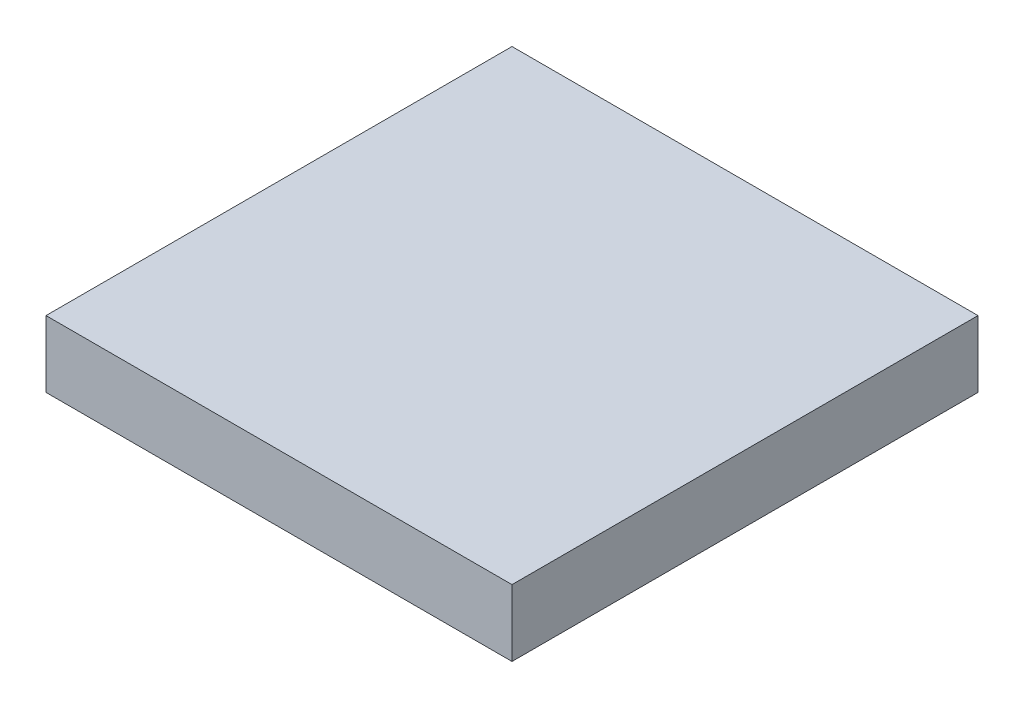
ISO-10303-21;
HEADER;
FILE_DESCRIPTION(('STEP AP214'),'2;1');
FILE_NAME('part.step','',(''),(''),'','','');
FILE_SCHEMA(('AUTOMOTIVE_DESIGN { 1 0 10303 214 1 1 1 1 }'));
ENDSEC;
DATA;
#1=APPLICATION_CONTEXT('core data for automotive mechanical design processes');
#2=APPLICATION_PROTOCOL_DEFINITION('international standard','automotive_design',2000,#1);
#3=PRODUCT_CONTEXT('',#1,'mechanical');
#4=PRODUCT('Part','Part','',(#3));
#5=PRODUCT_RELATED_PRODUCT_CATEGORY('part','',(#4));
#6=PRODUCT_DEFINITION_FORMATION('','',#4);
#7=PRODUCT_DEFINITION_CONTEXT('part definition',#1,'design');
#8=PRODUCT_DEFINITION('design','',#6,#7);
#9=PRODUCT_DEFINITION_SHAPE('','',#8);
#10=(LENGTH_UNIT() NAMED_UNIT(*) SI_UNIT(.MILLI.,.METRE.));
#11=(NAMED_UNIT(*) PLANE_ANGLE_UNIT() SI_UNIT($,.RADIAN.));
#12=(NAMED_UNIT(*) SI_UNIT($,.STERADIAN.) SOLID_ANGLE_UNIT());
#13=UNCERTAINTY_MEASURE_WITH_UNIT(LENGTH_MEASURE(1.E-05),#10,'distance_accuracy_value','');
#14=(GEOMETRIC_REPRESENTATION_CONTEXT(3) GLOBAL_UNCERTAINTY_ASSIGNED_CONTEXT((#13)) GLOBAL_UNIT_ASSIGNED_CONTEXT((#10,
#11,#12)) REPRESENTATION_CONTEXT('',''));
#15=CARTESIAN_POINT('',(0.,0.,0.));
#16=DIRECTION('',(0.,0.,1.));
#17=DIRECTION('',(1.,0.,0.));
#18=AXIS2_PLACEMENT_3D('',#15,#16,#17);
#19=CARTESIAN_POINT('',(7.,2.,-7.));
#20=DIRECTION('',(-1.,0.,0.));
#21=DIRECTION('',(0.,0.,1.));
#22=AXIS2_PLACEMENT_3D('',#19,#20,#21);
#23=PLANE('',#22);
#24=DIRECTION('',(0.,0.,-1.));
#25=VECTOR('',#24,1.);
#26=CARTESIAN_POINT('',(7.,0.,-7.));
#27=LINE('',#26,#25);
#28=CARTESIAN_POINT('',(7.,0.,7.));
#29=VERTEX_POINT('',#28);
#30=CARTESIAN_POINT('',(7.,0.,-7.));
#31=VERTEX_POINT('',#30);
#32=EDGE_CURVE('E106',#29,#31,#27,.T.);
#33=ORIENTED_EDGE('',*,*,#32,.T.);
#34=DIRECTION('',(0.,-1.,0.));
#35=VECTOR('',#34,1.);
#36=CARTESIAN_POINT('',(7.,2.,-7.));
#37=LINE('',#36,#35);
#38=CARTESIAN_POINT('',(7.,2.,-7.));
#39=VERTEX_POINT('',#38);
#40=EDGE_CURVE('E11',#39,#31,#37,.T.);
#41=ORIENTED_EDGE('',*,*,#40,.F.);
#42=DIRECTION('',(0.,0.,-1.));
#43=VECTOR('',#42,1.);
#44=CARTESIAN_POINT('',(7.,2.,-7.));
#45=LINE('',#44,#43);
#46=CARTESIAN_POINT('',(7.,2.,7.));
#47=VERTEX_POINT('',#46);
#48=EDGE_CURVE('E94',#47,#39,#45,.T.);
#49=ORIENTED_EDGE('',*,*,#48,.F.);
#50=DIRECTION('',(0.,-1.,0.));
#51=VECTOR('',#50,1.);
#52=CARTESIAN_POINT('',(7.,2.,7.));
#53=LINE('',#52,#51);
#54=EDGE_CURVE('E102',#47,#29,#53,.T.);
#55=ORIENTED_EDGE('',*,*,#54,.T.);
#56=EDGE_LOOP('',(#33,#41,#49,#55));
#57=FACE_BOUND('',#56,.T.);
#58=ADVANCED_FACE('F43',(#57),#23,.F.);
#59=CARTESIAN_POINT('',(-7.,2.,-7.));
#60=DIRECTION('',(0.,0.,1.));
#61=DIRECTION('',(1.,0.,0.));
#62=AXIS2_PLACEMENT_3D('',#59,#60,#61);
#63=PLANE('',#62);
#64=DIRECTION('',(-1.,0.,0.));
#65=VECTOR('',#64,1.);
#66=CARTESIAN_POINT('',(-7.,0.,-7.));
#67=LINE('',#66,#65);
#68=CARTESIAN_POINT('',(-7.,0.,-7.));
#69=VERTEX_POINT('',#68);
#70=EDGE_CURVE('E98',#31,#69,#67,.T.);
#71=ORIENTED_EDGE('',*,*,#70,.T.);
#72=DIRECTION('',(0.,-1.,0.));
#73=VECTOR('',#72,1.);
#74=CARTESIAN_POINT('',(-7.,2.,-7.));
#75=LINE('',#74,#73);
#76=CARTESIAN_POINT('',(-7.,2.,-7.));
#77=VERTEX_POINT('',#76);
#78=EDGE_CURVE('E51',#77,#69,#75,.T.);
#79=ORIENTED_EDGE('',*,*,#78,.F.);
#80=DIRECTION('',(-1.,0.,0.));
#81=VECTOR('',#80,1.);
#82=CARTESIAN_POINT('',(-7.,2.,-7.));
#83=LINE('',#82,#81);
#84=EDGE_CURVE('E89',#39,#77,#83,.T.);
#85=ORIENTED_EDGE('',*,*,#84,.F.);
#86=ORIENTED_EDGE('',*,*,#40,.T.);
#87=EDGE_LOOP('',(#71,#79,#85,#86));
#88=FACE_BOUND('',#87,.T.);
#89=ADVANCED_FACE('F97',(#88),#63,.F.);
#90=CARTESIAN_POINT('',(-7.,2.,-7.));
#91=DIRECTION('',(1.,0.,0.));
#92=DIRECTION('',(0.,0.,-1.));
#93=AXIS2_PLACEMENT_3D('',#90,#91,#92);
#94=PLANE('',#93);
#95=DIRECTION('',(0.,0.,1.));
#96=VECTOR('',#95,1.);
#97=CARTESIAN_POINT('',(-7.,0.,-7.));
#98=LINE('',#97,#96);
#99=CARTESIAN_POINT('',(-7.,0.,7.));
#100=VERTEX_POINT('',#99);
#101=EDGE_CURVE('E76',#69,#100,#98,.T.);
#102=ORIENTED_EDGE('',*,*,#101,.T.);
#103=DIRECTION('',(0.,-1.,0.));
#104=VECTOR('',#103,1.);
#105=CARTESIAN_POINT('',(-7.,2.,7.));
#106=LINE('',#105,#104);
#107=CARTESIAN_POINT('',(-7.,2.,7.));
#108=VERTEX_POINT('',#107);
#109=EDGE_CURVE('E99',#108,#100,#106,.T.);
#110=ORIENTED_EDGE('',*,*,#109,.F.);
#111=DIRECTION('',(0.,0.,1.));
#112=VECTOR('',#111,1.);
#113=CARTESIAN_POINT('',(-7.,2.,-7.));
#114=LINE('',#113,#112);
#115=EDGE_CURVE('E92',#77,#108,#114,.T.);
#116=ORIENTED_EDGE('',*,*,#115,.F.);
#117=ORIENTED_EDGE('',*,*,#78,.T.);
#118=EDGE_LOOP('',(#102,#110,#116,#117));
#119=FACE_BOUND('',#118,.T.);
#120=ADVANCED_FACE('F100',(#119),#94,.F.);
#121=CARTESIAN_POINT('',(-7.,2.,7.));
#122=DIRECTION('',(0.,0.,-1.));
#123=DIRECTION('',(-1.,0.,0.));
#124=AXIS2_PLACEMENT_3D('',#121,#122,#123);
#125=PLANE('',#124);
#126=DIRECTION('',(1.,0.,0.));
#127=VECTOR('',#126,1.);
#128=CARTESIAN_POINT('',(-7.,0.,7.));
#129=LINE('',#128,#127);
#130=EDGE_CURVE('E82',#100,#29,#129,.T.);
#131=ORIENTED_EDGE('',*,*,#130,.T.);
#132=ORIENTED_EDGE('',*,*,#54,.F.);
#133=DIRECTION('',(1.,0.,0.));
#134=VECTOR('',#133,1.);
#135=CARTESIAN_POINT('',(-7.,2.,7.));
#136=LINE('',#135,#134);
#137=EDGE_CURVE('E59',#108,#47,#136,.T.);
#138=ORIENTED_EDGE('',*,*,#137,.F.);
#139=ORIENTED_EDGE('',*,*,#109,.T.);
#140=EDGE_LOOP('',(#131,#132,#138,#139));
#141=FACE_BOUND('',#140,.T.);
#142=ADVANCED_FACE('F113',(#141),#125,.F.);
#143=CARTESIAN_POINT('',(0.,2.,0.));
#144=DIRECTION('',(0.,1.,0.));
#145=DIRECTION('',(0.,0.,1.));
#146=AXIS2_PLACEMENT_3D('',#143,#144,#145);
#147=PLANE('',#146);
#148=ORIENTED_EDGE('',*,*,#48,.T.);
#149=ORIENTED_EDGE('',*,*,#84,.T.);
#150=ORIENTED_EDGE('',*,*,#115,.T.);
#151=ORIENTED_EDGE('',*,*,#137,.T.);
#152=EDGE_LOOP('',(#148,#149,#150,#151));
#153=FACE_BOUND('',#152,.T.);
#154=ADVANCED_FACE('F90',(#153),#147,.T.);
#155=CARTESIAN_POINT('',(0.,0.,0.));
#156=DIRECTION('',(0.,1.,0.));
#157=DIRECTION('',(0.,0.,1.));
#158=AXIS2_PLACEMENT_3D('',#155,#156,#157);
#159=PLANE('',#158);
#160=ORIENTED_EDGE('',*,*,#32,.F.);
#161=ORIENTED_EDGE('',*,*,#130,.F.);
#162=ORIENTED_EDGE('',*,*,#101,.F.);
#163=ORIENTED_EDGE('',*,*,#70,.F.);
#164=EDGE_LOOP('',(#160,#161,#162,#163));
#165=FACE_BOUND('',#164,.T.);
#166=ADVANCED_FACE('F116',(#165),#159,.F.);
#167=CLOSED_SHELL('',(#58,#89,#120,#142,#154,#166));
#168=MANIFOLD_SOLID_BREP('B2',#167);
#169=ADVANCED_BREP_SHAPE_REPRESENTATION('',(#18,#168),#14);
#170=SHAPE_DEFINITION_REPRESENTATION(#9,#169);
ENDSEC;
END-ISO-10303-21;
